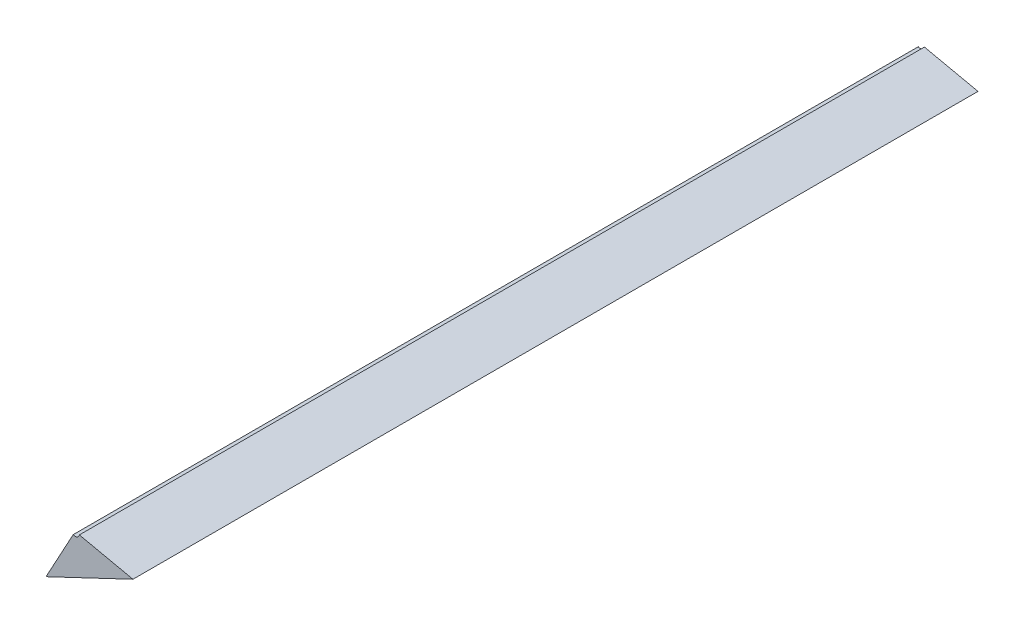
ISO-10303-21;
HEADER;
FILE_DESCRIPTION(('STEP AP214'),'2;1');
FILE_NAME('part.step','',(''),(''),'','','');
FILE_SCHEMA(('AUTOMOTIVE_DESIGN { 1 0 10303 214 1 1 1 1 }'));
ENDSEC;
DATA;
#1=APPLICATION_CONTEXT('core data for automotive mechanical design processes');
#2=APPLICATION_PROTOCOL_DEFINITION('international standard','automotive_design',2000,#1);
#3=PRODUCT_CONTEXT('',#1,'mechanical');
#4=PRODUCT('Part','Part','',(#3));
#5=PRODUCT_RELATED_PRODUCT_CATEGORY('part','',(#4));
#6=PRODUCT_DEFINITION_FORMATION('','',#4);
#7=PRODUCT_DEFINITION_CONTEXT('part definition',#1,'design');
#8=PRODUCT_DEFINITION('design','',#6,#7);
#9=PRODUCT_DEFINITION_SHAPE('','',#8);
#10=(LENGTH_UNIT() NAMED_UNIT(*) SI_UNIT(.MILLI.,.METRE.));
#11=(NAMED_UNIT(*) PLANE_ANGLE_UNIT() SI_UNIT($,.RADIAN.));
#12=(NAMED_UNIT(*) SI_UNIT($,.STERADIAN.) SOLID_ANGLE_UNIT());
#13=UNCERTAINTY_MEASURE_WITH_UNIT(LENGTH_MEASURE(1.E-05),#10,'distance_accuracy_value','');
#14=(GEOMETRIC_REPRESENTATION_CONTEXT(3) GLOBAL_UNCERTAINTY_ASSIGNED_CONTEXT((#13)) GLOBAL_UNIT_ASSIGNED_CONTEXT((#10,
#11,#12)) REPRESENTATION_CONTEXT('',''));
#15=CARTESIAN_POINT('',(0.,0.,0.));
#16=DIRECTION('',(0.,0.,1.));
#17=DIRECTION('',(1.,0.,0.));
#18=AXIS2_PLACEMENT_3D('',#15,#16,#17);
#19=CARTESIAN_POINT('',(-1.301513234463,-0.398546889036204,0.1));
#20=DIRECTION('',(0.,0.,1.));
#21=DIRECTION('',(-1.,0.,0.));
#22=AXIS2_PLACEMENT_3D('',#19,#20,#21);
#23=CYLINDRICAL_SURFACE('',#22,0.0005);
#24=DIRECTION('',(0.,0.,-1.));
#25=VECTOR('',#24,1.);
#26=CARTESIAN_POINT('',(-1.3017525286604,-0.398985908724936,0.1));
#27=LINE('',#26,#25);
#28=CARTESIAN_POINT('',(-1.3017525286604,-0.398985908724936,0.1));
#29=VERTEX_POINT('',#28);
#30=CARTESIAN_POINT('',(-1.3017525286604,-0.398985908724936,0.));
#31=VERTEX_POINT('',#30);
#32=EDGE_CURVE('E11',#29,#31,#27,.T.);
#33=ORIENTED_EDGE('',*,*,#32,.F.);
#34=CARTESIAN_POINT('',(-1.301513234463,-0.398546889036204,0.1));
#35=DIRECTION('',(0.,0.,-1.));
#36=DIRECTION('',(-1.,0.,0.));
#37=AXIS2_PLACEMENT_3D('',#34,#35,#36);
#38=CIRCLE('',#37,0.0005);
#39=CARTESIAN_POINT('',(-1.3010244244931,-0.398652078452229,0.1));
#40=VERTEX_POINT('',#39);
#41=EDGE_CURVE('E24',#40,#29,#38,.T.);
#42=ORIENTED_EDGE('',*,*,#41,.F.);
#43=DIRECTION('',(0.,0.,1.));
#44=VECTOR('',#43,1.);
#45=CARTESIAN_POINT('',(-1.3010244244931,-0.398652078452229,0.1));
#46=LINE('',#45,#44);
#47=CARTESIAN_POINT('',(-1.3010244244931,-0.398652078452229,0.));
#48=VERTEX_POINT('',#47);
#49=EDGE_CURVE('E133',#48,#40,#46,.T.);
#50=ORIENTED_EDGE('',*,*,#49,.F.);
#51=CARTESIAN_POINT('',(-1.301513234463,-0.398546889036204,0.));
#52=DIRECTION('',(0.,0.,1.));
#53=DIRECTION('',(-1.,0.,0.));
#54=AXIS2_PLACEMENT_3D('',#51,#52,#53);
#55=CIRCLE('',#54,0.0005);
#56=EDGE_CURVE('E37',#31,#48,#55,.T.);
#57=ORIENTED_EDGE('',*,*,#56,.F.);
#58=EDGE_LOOP('',(#33,#42,#50,#57));
#59=FACE_BOUND('',#58,.T.);
#60=ADVANCED_FACE('F17',(#59),#23,.F.);
#61=CARTESIAN_POINT('',(-1.301513234463,-0.398546889036204,0.));
#62=DIRECTION('',(-0.210378832050014,-0.977619939969144,0.));
#63=DIRECTION('',(0.977619939969144,-0.210378832050014,0.));
#64=AXIS2_PLACEMENT_3D('',#61,#62,#63);
#65=PLANE('',#64);
#66=ORIENTED_EDGE('',*,*,#49,.T.);
#67=DIRECTION('',(0.977619939969144,-0.210378832050014,0.));
#68=VECTOR('',#67,1.);
#69=CARTESIAN_POINT('',(-1.301513234463,-0.398546889036204,0.1));
#70=LINE('',#69,#68);
#71=CARTESIAN_POINT('',(-1.2946807792137,-0.400025448708465,0.1));
#72=VERTEX_POINT('',#71);
#73=EDGE_CURVE('E134',#40,#72,#70,.T.);
#74=ORIENTED_EDGE('',*,*,#73,.T.);
#75=CARTESIAN_POINT('',(-1.29468175757776,-0.400016988069105,0.1));
#76=DIRECTION('',(0.,0.,-1.));
#77=VECTOR('',#76,1.);
#78=LINE('',#75,#77);
#79=CARTESIAN_POINT('',(-1.2946807792137,-0.400025448708465,0.));
#80=VERTEX_POINT('',#79);
#81=EDGE_CURVE('E114',#72,#80,#78,.T.);
#82=ORIENTED_EDGE('',*,*,#81,.T.);
#83=DIRECTION('',(0.977619939969144,-0.210378832050014,0.));
#84=VECTOR('',#83,1.);
#85=CARTESIAN_POINT('',(-1.301513234463,-0.398546889036204,0.));
#86=LINE('',#85,#84);
#87=EDGE_CURVE('E64',#48,#80,#86,.T.);
#88=ORIENTED_EDGE('',*,*,#87,.F.);
#89=EDGE_LOOP('',(#66,#74,#82,#88));
#90=FACE_BOUND('',#89,.T.);
#91=ADVANCED_FACE('F119',(#90),#65,.F.);
#92=CARTESIAN_POINT('',(-1.3002321890962,-0.4015821232958,0.1));
#93=DIRECTION('',(0.,0.,-1.));
#94=DIRECTION('',(-1.,0.,0.));
#95=AXIS2_PLACEMENT_3D('',#92,#93,#94);
#96=PLANE('',#95);
#97=DIRECTION('',(-0.903806397975911,-0.427941578930827,0.));
#98=VECTOR('',#97,1.);
#99=CARTESIAN_POINT('',(-1.2941929476078,-0.40012217748513,0.1));
#100=LINE('',#99,#98);
#101=CARTESIAN_POINT('',(-1.304972449461,-0.404908428179549,0.1));
#102=VERTEX_POINT('',#101);
#103=EDGE_CURVE('E73',#72,#102,#100,.T.);
#104=ORIENTED_EDGE('',*,*,#103,.F.);
#105=ORIENTED_EDGE('',*,*,#73,.F.);
#106=ORIENTED_EDGE('',*,*,#41,.T.);
#107=DIRECTION('',(0.478588394782355,0.878039377465298,0.));
#108=VECTOR('',#107,1.);
#109=CARTESIAN_POINT('',(-1.3052169665858,-0.405341919343764,0.1));
#110=LINE('',#109,#108);
#111=EDGE_CURVE('E77',#102,#29,#110,.T.);
#112=ORIENTED_EDGE('',*,*,#111,.F.);
#113=EDGE_LOOP('',(#104,#105,#106,#112));
#114=FACE_BOUND('',#113,.T.);
#115=ADVANCED_FACE('F98',(#114),#96,.F.);
#116=CARTESIAN_POINT('',(-1.2941929476078,-0.40012217748513,0.));
#117=DIRECTION('',(-0.427941578930827,0.903806397975911,0.));
#118=DIRECTION('',(-0.903806397975911,-0.427941578930827,0.));
#119=AXIS2_PLACEMENT_3D('',#116,#117,#118);
#120=PLANE('',#119);
#121=ORIENTED_EDGE('',*,*,#81,.F.);
#122=ORIENTED_EDGE('',*,*,#103,.T.);
#123=CARTESIAN_POINT('',(-1.30497767238841,-0.404902899655032,0.));
#124=DIRECTION('',(0.,0.,1.));
#125=VECTOR('',#124,1.);
#126=LINE('',#123,#125);
#127=CARTESIAN_POINT('',(-1.304972449461,-0.404908428179549,0.));
#128=VERTEX_POINT('',#127);
#129=EDGE_CURVE('E67',#128,#102,#126,.T.);
#130=ORIENTED_EDGE('',*,*,#129,.F.);
#131=DIRECTION('',(-0.903806397975911,-0.427941578930827,0.));
#132=VECTOR('',#131,1.);
#133=CARTESIAN_POINT('',(-1.2941929476078,-0.40012217748513,0.));
#134=LINE('',#133,#132);
#135=EDGE_CURVE('E58',#80,#128,#134,.T.);
#136=ORIENTED_EDGE('',*,*,#135,.F.);
#137=EDGE_LOOP('',(#121,#122,#130,#136));
#138=FACE_BOUND('',#137,.T.);
#139=ADVANCED_FACE('F71',(#138),#120,.F.);
#140=CARTESIAN_POINT('',(-1.3052169665858,-0.405341919343764,0.));
#141=DIRECTION('',(0.878039377465299,-0.478588394782355,0.));
#142=DIRECTION('',(0.478588394782355,0.878039377465299,0.));
#143=AXIS2_PLACEMENT_3D('',#140,#141,#142);
#144=PLANE('',#143);
#145=ORIENTED_EDGE('',*,*,#32,.T.);
#146=DIRECTION('',(0.478588394782355,0.878039377465298,0.));
#147=VECTOR('',#146,1.);
#148=CARTESIAN_POINT('',(-1.3052169665858,-0.405341919343764,0.));
#149=LINE('',#148,#147);
#150=EDGE_CURVE('E62',#128,#31,#149,.T.);
#151=ORIENTED_EDGE('',*,*,#150,.F.);
#152=ORIENTED_EDGE('',*,*,#129,.T.);
#153=ORIENTED_EDGE('',*,*,#111,.T.);
#154=EDGE_LOOP('',(#145,#151,#152,#153));
#155=FACE_BOUND('',#154,.T.);
#156=ADVANCED_FACE('F80',(#155),#144,.F.);
#157=CARTESIAN_POINT('',(-1.3002321890962,-0.4015821232958,0.));
#158=DIRECTION('',(0.,0.,-1.));
#159=DIRECTION('',(-1.,0.,0.));
#160=AXIS2_PLACEMENT_3D('',#157,#158,#159);
#161=PLANE('',#160);
#162=ORIENTED_EDGE('',*,*,#150,.T.);
#163=ORIENTED_EDGE('',*,*,#56,.T.);
#164=ORIENTED_EDGE('',*,*,#87,.T.);
#165=ORIENTED_EDGE('',*,*,#135,.T.);
#166=EDGE_LOOP('',(#162,#163,#164,#165));
#167=FACE_BOUND('',#166,.T.);
#168=ADVANCED_FACE('F60',(#167),#161,.T.);
#169=CLOSED_SHELL('',(#60,#91,#115,#139,#156,#168));
#170=MANIFOLD_SOLID_BREP('B1',#169);
#171=ADVANCED_BREP_SHAPE_REPRESENTATION('',(#18,#170),#14);
#172=SHAPE_DEFINITION_REPRESENTATION(#9,#171);
ENDSEC;
END-ISO-10303-21;
